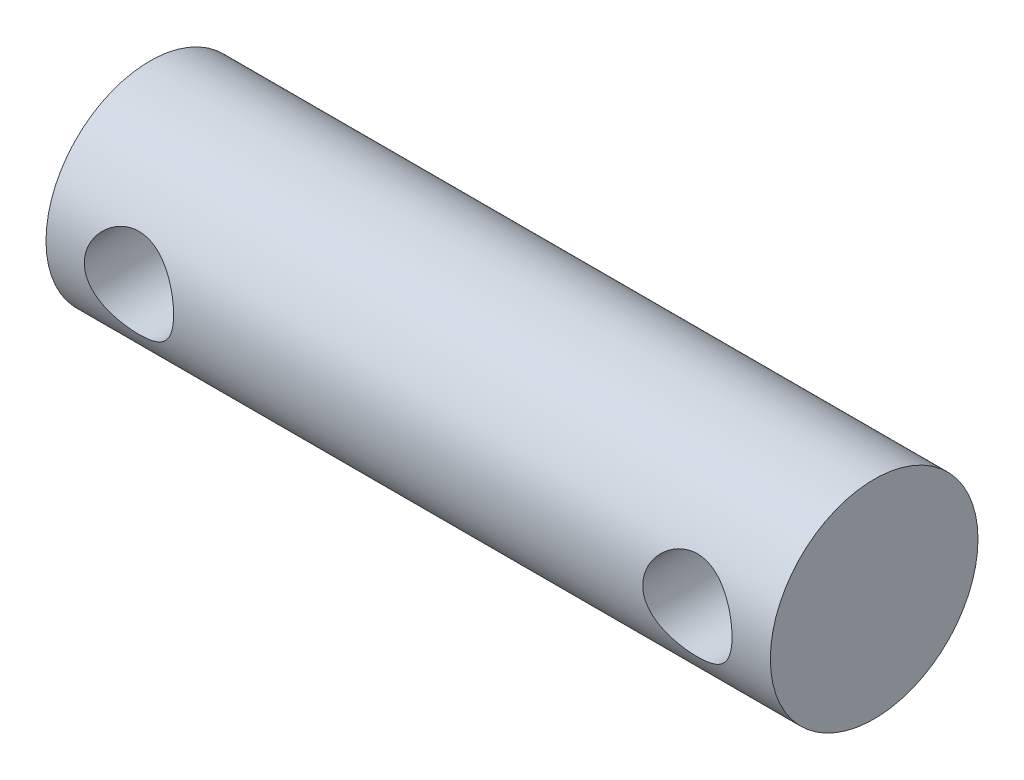
ISO-10303-21;
HEADER;
FILE_DESCRIPTION(('STEP AP214'),'2;1');
FILE_NAME('part.step','',(''),(''),'','','');
FILE_SCHEMA(('AUTOMOTIVE_DESIGN { 1 0 10303 214 1 1 1 1 }'));
ENDSEC;
DATA;
#1=APPLICATION_CONTEXT('core data for automotive mechanical design processes');
#2=APPLICATION_PROTOCOL_DEFINITION('international standard','automotive_design',2000,#1);
#3=PRODUCT_CONTEXT('',#1,'mechanical');
#4=PRODUCT('Part','Part','',(#3));
#5=PRODUCT_RELATED_PRODUCT_CATEGORY('part','',(#4));
#6=PRODUCT_DEFINITION_FORMATION('','',#4);
#7=PRODUCT_DEFINITION_CONTEXT('part definition',#1,'design');
#8=PRODUCT_DEFINITION('design','',#6,#7);
#9=PRODUCT_DEFINITION_SHAPE('','',#8);
#10=(LENGTH_UNIT() NAMED_UNIT(*) SI_UNIT(.MILLI.,.METRE.));
#11=(NAMED_UNIT(*) PLANE_ANGLE_UNIT() SI_UNIT($,.RADIAN.));
#12=(NAMED_UNIT(*) SI_UNIT($,.STERADIAN.) SOLID_ANGLE_UNIT());
#13=UNCERTAINTY_MEASURE_WITH_UNIT(LENGTH_MEASURE(1.E-05),#10,'distance_accuracy_value','');
#14=(GEOMETRIC_REPRESENTATION_CONTEXT(3) GLOBAL_UNCERTAINTY_ASSIGNED_CONTEXT((#13)) GLOBAL_UNIT_ASSIGNED_CONTEXT((#10,
#11,#12)) REPRESENTATION_CONTEXT('',''));
#15=CARTESIAN_POINT('',(0.,0.,0.));
#16=DIRECTION('',(0.,0.,1.));
#17=DIRECTION('',(1.,0.,0.));
#18=AXIS2_PLACEMENT_3D('',#15,#16,#17);
#19=CARTESIAN_POINT('',(20.8457458767143,49.8361725350088,-136.328078847471));
#20=DIRECTION('',(1.,0.,0.));
#21=DIRECTION('',(0.,0.,-1.));
#22=AXIS2_PLACEMENT_3D('',#19,#20,#21);
#23=CYLINDRICAL_SURFACE('',#22,4.99999999999999);
#24=CARTESIAN_POINT('',(53.8807458847143,49.8361725350088,-141.328078847471));
#25=CARTESIAN_POINT('',(53.8807411802356,49.7213369896127,-141.328075067452));
#26=CARTESIAN_POINT('',(53.8714914076802,49.6063117996981,-141.324078109135));
#27=CARTESIAN_POINT('',(53.8348490346011,49.3795494889542,-141.308488774647));
#28=CARTESIAN_POINT('',(53.8074108191502,49.2678213746283,-141.296877302769));
#29=CARTESIAN_POINT('',(53.7355962268532,49.0512930292338,-141.267295678108));
#30=CARTESIAN_POINT('',(53.691278719821,48.9464701885056,-141.249347641043));
#31=CARTESIAN_POINT('',(53.5872173106792,48.7458550672259,-141.208826250953));
#32=CARTESIAN_POINT('',(53.5274775283895,48.6500603842579,-141.186254133511));
#33=CARTESIAN_POINT('',(53.3909438294606,48.4650074029306,-141.137393073467));
#34=CARTESIAN_POINT('',(53.3134662866216,48.3762872805437,-141.110977364866));
#35=CARTESIAN_POINT('',(53.1451045551984,48.2126316034261,-141.057934030835));
#36=CARTESIAN_POINT('',(53.0542129263495,48.13770375089,-141.031306295606));
#37=CARTESIAN_POINT('',(52.8557515060694,47.9998117612172,-140.979261881125));
#38=CARTESIAN_POINT('',(52.7475517668871,47.9376959146999,-140.95398494367));
#39=CARTESIAN_POINT('',(52.5209996221841,47.8327860678183,-140.909532004697));
#40=CARTESIAN_POINT('',(52.4026528223709,47.7899814798279,-140.890352661809));
#41=CARTESIAN_POINT('',(52.1653608016077,47.7271680330151,-140.861647577703));
#42=CARTESIAN_POINT('',(52.046745718155,47.706119948683,-140.851684409893));
#43=CARTESIAN_POINT('',(51.807281353157,47.6841793415416,-140.841291526017));
#44=CARTESIAN_POINT('',(51.686433466394,47.6832746350607,-140.840856047155));
#45=CARTESIAN_POINT('',(51.4566077729839,47.7008674530557,-140.849200025902));
#46=CARTESIAN_POINT('',(51.3474744484552,47.7177674928992,-140.857220810386));
#47=CARTESIAN_POINT('',(51.1337769439751,47.7677973338567,-140.880284318974));
#48=CARTESIAN_POINT('',(51.0292137128958,47.8009304881213,-140.895328493815));
#49=CARTESIAN_POINT('',(50.8248988952264,47.8831394881385,-140.931088855414));
#50=CARTESIAN_POINT('',(50.7253027276143,47.9325484248617,-140.951921987515));
#51=CARTESIAN_POINT('',(50.5354113274809,48.0456692162852,-140.99688993182));
#52=CARTESIAN_POINT('',(50.4451199115105,48.1093869062414,-141.021026089459));
#53=CARTESIAN_POINT('',(50.2677937446391,48.2560839552132,-141.072537302096));
#54=CARTESIAN_POINT('',(50.1817944834399,48.3402851248689,-141.100007723881));
#55=CARTESIAN_POINT('',(50.024776774551,48.5221680494348,-141.153259303188));
#56=CARTESIAN_POINT('',(49.9537623024733,48.6198533704806,-141.179040011164));
#57=CARTESIAN_POINT('',(49.8270746565194,48.8292531847971,-141.226846767644));
#58=CARTESIAN_POINT('',(49.7718489694413,48.941266686661,-141.248757604676));
#59=CARTESIAN_POINT('',(49.6813936690745,49.1741779591023,-141.285459672719));
#60=CARTESIAN_POINT('',(49.6461522678741,49.2950704446931,-141.300255100035));
#61=CARTESIAN_POINT('',(49.598893970074,49.5336772935446,-141.320259588004));
#62=CARTESIAN_POINT('',(49.5854890533469,49.6510687769145,-141.326040481519));
#63=CARTESIAN_POINT('',(49.5781135891824,49.8865578475027,-141.329209719753));
#64=CARTESIAN_POINT('',(49.5841369915106,50.00465520347,-141.326600677208));
#65=CARTESIAN_POINT('',(49.6144774032279,50.2315292037977,-141.313650457344));
#66=CARTESIAN_POINT('',(49.6377967120125,50.3404661743029,-141.303731158168));
#67=CARTESIAN_POINT('',(49.7006526219519,50.552747879974,-141.277620687335));
#68=CARTESIAN_POINT('',(49.7401912371047,50.6560919188449,-141.261428736797));
#69=CARTESIAN_POINT('',(49.8356450316057,50.8579082201138,-141.223681958431));
#70=CARTESIAN_POINT('',(49.892033179043,50.9561274704354,-141.201975411841));
#71=CARTESIAN_POINT('',(50.0190684371405,51.1420637961909,-141.155484785512));
#72=CARTESIAN_POINT('',(50.0897216483134,51.2297763527376,-141.130699390841));
#73=CARTESIAN_POINT('',(50.249538736721,51.3992126278181,-141.07837927341));
#74=CARTESIAN_POINT('',(50.339700161327,51.4799774705762,-141.050778609613));
#75=CARTESIAN_POINT('',(50.5326921631512,51.6255241740811,-140.997579889869));
#76=CARTESIAN_POINT('',(50.6355263329052,51.6903014869005,-140.971982405171));
#77=CARTESIAN_POINT('',(50.8535852186567,51.8030016947206,-140.925402531285));
#78=CARTESIAN_POINT('',(50.9690032476606,51.8505922188222,-140.904513818171));
#79=CARTESIAN_POINT('',(51.2074016875701,51.9252333108666,-140.870933764693));
#80=CARTESIAN_POINT('',(51.3303752053673,51.9523023090478,-140.858235070464));
#81=CARTESIAN_POINT('',(51.5696865736272,51.9832456094708,-140.843645592454));
#82=CARTESIAN_POINT('',(51.6857573928043,51.9888178074857,-140.840964207638));
#83=CARTESIAN_POINT('',(51.9171262787046,51.9812020213465,-140.844589461941));
#84=CARTESIAN_POINT('',(52.0324244803064,51.9680174021423,-140.850894488908));
#85=CARTESIAN_POINT('',(52.2526801151096,51.9247183126663,-140.871039887736));
#86=CARTESIAN_POINT('',(52.3578621557099,51.8955340173604,-140.884465029838));
#87=CARTESIAN_POINT('',(52.5618442720251,51.822006970618,-140.916985989167));
#88=CARTESIAN_POINT('',(52.6606425210889,51.7776599031602,-140.936083420785));
#89=CARTESIAN_POINT('',(52.8557679014342,51.671900332346,-140.979267334837));
#90=CARTESIAN_POINT('',(52.9515594848078,51.6095982359687,-141.003590182213));
#91=CARTESIAN_POINT('',(53.1318582364724,51.4708994582845,-141.053870384485));
#92=CARTESIAN_POINT('',(53.2163610755024,51.3944973962034,-141.079828360873));
#93=CARTESIAN_POINT('',(53.3786223322724,51.2225566990761,-141.132936176252));
#94=CARTESIAN_POINT('',(53.4553073133174,51.125978489302,-141.160016245078));
#95=CARTESIAN_POINT('',(53.591465044063,50.9203428016935,-141.210267086977));
#96=CARTESIAN_POINT('',(53.6509299899203,50.8112796970469,-141.233436085639));
#97=CARTESIAN_POINT('',(53.7497896395524,50.5851555298285,-141.272976217368));
#98=CARTESIAN_POINT('',(53.7894593946621,50.4682312655781,-141.289439891174));
#99=CARTESIAN_POINT('',(53.8481834507368,50.2286930464141,-141.314091221618));
#100=CARTESIAN_POINT('',(53.8673015341711,50.1060979337551,-141.322304478337));
#101=CARTESIAN_POINT('',(53.8774059326409,49.9584610253603,-141.326643793397));
#102=CARTESIAN_POINT('',(53.8786573438208,49.9340255241093,-141.32718109063));
#103=CARTESIAN_POINT('',(53.8803278240239,49.8851203993388,-141.327899021725));
#104=CARTESIAN_POINT('',(53.8807468875168,49.8606507755937,-141.328079653217));
#105=CARTESIAN_POINT('',(53.8807458847143,49.8361725350088,-141.328078847471));
#106=B_SPLINE_CURVE_WITH_KNOTS('',3,(#24,#25,#26,#27,#28,#29,#30,#31,#32,#33,#34,#35,#36,#37,
#38,#39,#40,#41,#42,#43,#44,#45,#46,#47,#48,#49,#50,#51,#52,#53,#54,#55,#56,#57,#58,#59,#60,#61,
#62,#63,#64,#65,#66,#67,#68,#69,#70,#71,#72,#73,#74,#75,#76,#77,#78,#79,#80,#81,#82,#83,#84,#85,
#86,#87,#88,#89,#90,#91,#92,#93,#94,#95,#96,#97,#98,#99,#100,#101,#102,#103,#104,#105),
.UNSPECIFIED.,.T.,.F.,(4,2,2,2,2,2,2,2,2,2,2,2,2,2,2,2,2,2,2,2,2,2,2,2,2,2,2,2,2,2,2,2,2,2,2,2,
2,2,2,2,4),(0.,0.344405597006513,0.689678215710455,1.03375749548488,1.37774495479788,
1.73832500006838,2.09910580181024,2.47907574725535,2.85883711575798,3.2194780043205,
3.579900754214,3.91053324750238,4.24123406583687,4.57917351290038,4.91725102620772,
5.28594614852576,5.65473896663791,6.03313216257345,6.41130192707087,6.76433488987351,
7.11725792417767,7.45126692486653,7.78531741297641,8.1298024719689,8.4744351646423,
8.84520811413964,9.21608641511609,9.59379501860373,9.97116400148108,10.3180317835198,
10.6648373457531,10.9933406179796,11.3219374752747,11.6709643688181,12.0201247331079,
12.397098263593,12.774242366029,13.1459890606213,13.5165786721775,13.5899913687512,
13.6634045530858),.UNSPECIFIED.);
#107=CARTESIAN_POINT('',(53.8807458847143,49.8361725350088,-141.328078847471));
#108=VERTEX_POINT('',#107);
#109=EDGE_CURVE('E10',#108,#108,#106,.T.);
#110=ORIENTED_EDGE('',*,*,#109,.F.);
#111=EDGE_LOOP('',(#110));
#112=FACE_BOUND('',#111,.T.);
#113=CARTESIAN_POINT('',(53.8807458847143,49.8361725350088,-131.328078847471));
#114=CARTESIAN_POINT('',(53.8807411802356,49.9510080804048,-131.32808262749));
#115=CARTESIAN_POINT('',(53.8714914076802,50.0660332703194,-131.332079585807));
#116=CARTESIAN_POINT('',(53.8348490346011,50.2927955810633,-131.347668920295));
#117=CARTESIAN_POINT('',(53.8074108191503,50.4045236953892,-131.359280392173));
#118=CARTESIAN_POINT('',(53.7355962268533,50.6210520407837,-131.388862016835));
#119=CARTESIAN_POINT('',(53.691278719821,50.7258748815119,-131.4068100539));
#120=CARTESIAN_POINT('',(53.5872173106792,50.9264900027917,-131.447331443989));
#121=CARTESIAN_POINT('',(53.5274775283895,51.0222846857596,-131.469903561432));
#122=CARTESIAN_POINT('',(53.3909438294606,51.2073376670869,-131.518764621476));
#123=CARTESIAN_POINT('',(53.3134662866216,51.2960577894738,-131.545180330076));
#124=CARTESIAN_POINT('',(53.1451045551984,51.4597134665914,-131.598223664108));
#125=CARTESIAN_POINT('',(53.0542129263496,51.5346413191275,-131.624851399336));
#126=CARTESIAN_POINT('',(52.8557515060694,51.6725333088004,-131.676895813818));
#127=CARTESIAN_POINT('',(52.7475517668871,51.7346491553176,-131.702172751273));
#128=CARTESIAN_POINT('',(52.5209996221841,51.8395590021992,-131.746625690245));
#129=CARTESIAN_POINT('',(52.4026528223709,51.8823635901896,-131.765805033133));
#130=CARTESIAN_POINT('',(52.1653608016078,51.9451770370024,-131.794510117239));
#131=CARTESIAN_POINT('',(52.0467457181551,51.9662251213346,-131.804473285049));
#132=CARTESIAN_POINT('',(51.807281353157,51.9881657284759,-131.814866168925));
#133=CARTESIAN_POINT('',(51.686433466394,51.9890704349569,-131.815301647788));
#134=CARTESIAN_POINT('',(51.456607772984,51.9714776169619,-131.806957669041));
#135=CARTESIAN_POINT('',(51.3474744484552,51.9545775771183,-131.798936884557));
#136=CARTESIAN_POINT('',(51.1337769439752,51.9045477361609,-131.775873375969));
#137=CARTESIAN_POINT('',(51.0292137128958,51.8714145818962,-131.760829201127));
#138=CARTESIAN_POINT('',(50.8248988952264,51.789205581879,-131.725068839528));
#139=CARTESIAN_POINT('',(50.7253027276143,51.7397966451559,-131.704235707427));
#140=CARTESIAN_POINT('',(50.5354113274809,51.6266758537323,-131.659267763122));
#141=CARTESIAN_POINT('',(50.4451199115105,51.5629581637761,-131.635131605484));
#142=CARTESIAN_POINT('',(50.2677937446391,51.4162611148043,-131.583620392847));
#143=CARTESIAN_POINT('',(50.1817944834399,51.3320599451486,-131.556149971061));
#144=CARTESIAN_POINT('',(50.024776774551,51.1501770205827,-131.502898391754));
#145=CARTESIAN_POINT('',(49.9537623024733,51.052491699537,-131.477117683778));
#146=CARTESIAN_POINT('',(49.8270746565194,50.8430918852205,-131.429310927299));
#147=CARTESIAN_POINT('',(49.7718489694413,50.7310783833565,-131.407400090266));
#148=CARTESIAN_POINT('',(49.6813936690745,50.4981671109153,-131.370698022223));
#149=CARTESIAN_POINT('',(49.6461522678741,50.3772746253244,-131.355902594908));
#150=CARTESIAN_POINT('',(49.598893970074,50.1386677764729,-131.335898106939));
#151=CARTESIAN_POINT('',(49.5854890533469,50.0212762931031,-131.330117213423));
#152=CARTESIAN_POINT('',(49.5781135891825,49.7857872225149,-131.326947975189));
#153=CARTESIAN_POINT('',(49.5841369915106,49.6676898665475,-131.329557017734));
#154=CARTESIAN_POINT('',(49.6144774032279,49.4408158662198,-131.342507237599));
#155=CARTESIAN_POINT('',(49.6377967120125,49.3318788957146,-131.352426536774));
#156=CARTESIAN_POINT('',(49.7006526219519,49.1195971900435,-131.378537007608));
#157=CARTESIAN_POINT('',(49.7401912371047,49.0162531511726,-131.394728958145));
#158=CARTESIAN_POINT('',(49.8356450316057,48.8144368499038,-131.432475736512));
#159=CARTESIAN_POINT('',(49.892033179043,48.7162175995822,-131.454182283102));
#160=CARTESIAN_POINT('',(50.0190684371404,48.5302812738267,-131.500672909431));
#161=CARTESIAN_POINT('',(50.0897216483134,48.44256871728,-131.525458304101));
#162=CARTESIAN_POINT('',(50.249538736721,48.2731324421995,-131.577778421533));
#163=CARTESIAN_POINT('',(50.3397001613269,48.1923675994414,-131.605379085329));
#164=CARTESIAN_POINT('',(50.5326921631512,48.0468208959365,-131.658577805073));
#165=CARTESIAN_POINT('',(50.6355263329051,47.9820435831171,-131.684175289771));
#166=CARTESIAN_POINT('',(50.8535852186567,47.8693433752969,-131.730755163657));
#167=CARTESIAN_POINT('',(50.9690032476606,47.8217528511953,-131.751643876771));
#168=CARTESIAN_POINT('',(51.2074016875701,47.7471117591509,-131.785223930249));
#169=CARTESIAN_POINT('',(51.3303752053672,47.7200427609698,-131.797922624478));
#170=CARTESIAN_POINT('',(51.5696865736272,47.6890994605467,-131.812512102489));
#171=CARTESIAN_POINT('',(51.6857573928043,47.6835272625319,-131.815193487304));
#172=CARTESIAN_POINT('',(51.9171262787046,47.691143048671,-131.811568233002));
#173=CARTESIAN_POINT('',(52.0324244803064,47.7043276678752,-131.805263206034));
#174=CARTESIAN_POINT('',(52.2526801151096,47.7476267573512,-131.785117807206));
#175=CARTESIAN_POINT('',(52.3578621557099,47.7768110526571,-131.771692665105));
#176=CARTESIAN_POINT('',(52.5618442720251,47.8503380993996,-131.739171705775));
#177=CARTESIAN_POINT('',(52.6606425210889,47.8946851668573,-131.720074274157));
#178=CARTESIAN_POINT('',(52.8557679014342,48.0004447376715,-131.676890360105));
#179=CARTESIAN_POINT('',(52.9515594848077,48.0627468340488,-131.652567512729));
#180=CARTESIAN_POINT('',(53.1318582364723,48.201445611733,-131.602287310457));
#181=CARTESIAN_POINT('',(53.2163610755024,48.2778476738141,-131.576329334069));
#182=CARTESIAN_POINT('',(53.3786223322724,48.4497883709415,-131.523221518691));
#183=CARTESIAN_POINT('',(53.4553073133174,48.5463665807155,-131.496141449865));
#184=CARTESIAN_POINT('',(53.591465044063,48.752002268324,-131.445890607965));
#185=CARTESIAN_POINT('',(53.6509299899202,48.8610653729706,-131.422721609303));
#186=CARTESIAN_POINT('',(53.7497896395524,49.087189540189,-131.383181477574));
#187=CARTESIAN_POINT('',(53.7894593946621,49.2041138044394,-131.366717803769));
#188=CARTESIAN_POINT('',(53.8481834507368,49.4436520236034,-131.342066473325));
#189=CARTESIAN_POINT('',(53.8673015341711,49.5662471362624,-131.333853216606));
#190=CARTESIAN_POINT('',(53.8774059326409,49.7138840446572,-131.329513901545));
#191=CARTESIAN_POINT('',(53.8786573438208,49.7383195459082,-131.328976604312));
#192=CARTESIAN_POINT('',(53.8803278240239,49.7872246706787,-131.328258673218));
#193=CARTESIAN_POINT('',(53.8807468875168,49.8116942944238,-131.328078041726));
#194=CARTESIAN_POINT('',(53.8807458847143,49.8361725350088,-131.328078847471));
#195=B_SPLINE_CURVE_WITH_KNOTS('',3,(#113,#114,#115,#116,#117,#118,#119,#120,#121,#122,#123,
#124,#125,#126,#127,#128,#129,#130,#131,#132,#133,#134,#135,#136,#137,#138,#139,#140,#141,#142,
#143,#144,#145,#146,#147,#148,#149,#150,#151,#152,#153,#154,#155,#156,#157,#158,#159,#160,#161,
#162,#163,#164,#165,#166,#167,#168,#169,#170,#171,#172,#173,#174,#175,#176,#177,#178,#179,#180,
#181,#182,#183,#184,#185,#186,#187,#188,#189,#190,#191,#192,#193,#194),.UNSPECIFIED.,.T.,.F.,(4,
2,2,2,2,2,2,2,2,2,2,2,2,2,2,2,2,2,2,2,2,2,2,2,2,2,2,2,2,2,2,2,2,2,2,2,2,2,2,2,4),(0.,
0.344405597006499,0.689678215710455,1.03375749548489,1.37774495479789,1.73832500006837,
2.09910580181024,2.47907574725534,2.85883711575796,3.21947800432048,3.579900754214,
3.91053324750237,4.24123406583686,4.57917351290038,4.91725102620771,5.28594614852574,
5.65473896663791,6.03313216257345,6.41130192707086,6.7643348898735,7.11725792417767,
7.45126692486653,7.78531741297641,8.12980247196888,8.47443516464229,8.84520811413963,
9.21608641511608,9.59379501860372,9.97116400148107,10.3180317835198,10.6648373457531,
10.9933406179797,11.3219374752747,11.6709643688181,12.0201247331079,12.397098263593,
12.774242366029,13.1459890606213,13.5165786721774,13.5899913687512,13.6634045530858),.UNSPECIFIED.);
#196=CARTESIAN_POINT('',(53.8807458847143,49.8361725350088,-131.328078847471));
#197=VERTEX_POINT('',#196);
#198=EDGE_CURVE('E43',#197,#197,#195,.T.);
#199=ORIENTED_EDGE('',*,*,#198,.F.);
#200=EDGE_LOOP('',(#199));
#201=FACE_BOUND('',#200,.T.);
#202=CARTESIAN_POINT('',(26.9907538847143,49.8361725350088,-141.328078847471));
#203=CARTESIAN_POINT('',(26.9907491802355,49.7213369896127,-141.328075067452));
#204=CARTESIAN_POINT('',(26.9814994076802,49.6063117996981,-141.324078109135));
#205=CARTESIAN_POINT('',(26.9448570346011,49.3795494889542,-141.308488774647));
#206=CARTESIAN_POINT('',(26.9174188191502,49.2678213746283,-141.296877302769));
#207=CARTESIAN_POINT('',(26.8456042268532,49.0512930292338,-141.267295678108));
#208=CARTESIAN_POINT('',(26.8012867198209,48.9464701885056,-141.249347641043));
#209=CARTESIAN_POINT('',(26.6972253106792,48.7458550672258,-141.208826250953));
#210=CARTESIAN_POINT('',(26.6374855283895,48.6500603842579,-141.186254133511));
#211=CARTESIAN_POINT('',(26.5009518294606,48.4650074029306,-141.137393073467));
#212=CARTESIAN_POINT('',(26.4234742866216,48.3762872805437,-141.110977364866));
#213=CARTESIAN_POINT('',(26.2551125551984,48.2126316034261,-141.057934030835));
#214=CARTESIAN_POINT('',(26.1642209263495,48.13770375089,-141.031306295606));
#215=CARTESIAN_POINT('',(25.9657595060693,47.9998117612172,-140.979261881125));
#216=CARTESIAN_POINT('',(25.857559766887,47.9376959146999,-140.95398494367));
#217=CARTESIAN_POINT('',(25.6310076221841,47.8327860678183,-140.909532004697));
#218=CARTESIAN_POINT('',(25.5126608223708,47.7899814798279,-140.890352661809));
#219=CARTESIAN_POINT('',(25.2753688016077,47.7271680330151,-140.861647577703));
#220=CARTESIAN_POINT('',(25.156753718155,47.706119948683,-140.851684409893));
#221=CARTESIAN_POINT('',(24.9172893531569,47.6841793415416,-140.841291526017));
#222=CARTESIAN_POINT('',(24.796441466394,47.6832746350607,-140.840856047155));
#223=CARTESIAN_POINT('',(24.5666157729839,47.7008674530557,-140.849200025902));
#224=CARTESIAN_POINT('',(24.4574824484551,47.7177674928992,-140.857220810386));
#225=CARTESIAN_POINT('',(24.2437849439751,47.7677973338567,-140.880284318973));
#226=CARTESIAN_POINT('',(24.1392217128958,47.8009304881213,-140.895328493815));
#227=CARTESIAN_POINT('',(23.9349068952263,47.8831394881385,-140.931088855414));
#228=CARTESIAN_POINT('',(23.8353107276143,47.9325484248617,-140.951921987515));
#229=CARTESIAN_POINT('',(23.6454193274809,48.0456692162852,-140.99688993182));
#230=CARTESIAN_POINT('',(23.5551279115105,48.1093869062414,-141.021026089458));
#231=CARTESIAN_POINT('',(23.3778017446391,48.2560839552132,-141.072537302095));
#232=CARTESIAN_POINT('',(23.2918024834399,48.3402851248689,-141.100007723881));
#233=CARTESIAN_POINT('',(23.1347847745509,48.5221680494348,-141.153259303188));
#234=CARTESIAN_POINT('',(23.0637703024732,48.6198533704806,-141.179040011164));
#235=CARTESIAN_POINT('',(22.9370826565194,48.8292531847971,-141.226846767644));
#236=CARTESIAN_POINT('',(22.8818569694413,48.941266686661,-141.248757604676));
#237=CARTESIAN_POINT('',(22.7914016690744,49.1741779591023,-141.285459672719));
#238=CARTESIAN_POINT('',(22.7561602678741,49.2950704446931,-141.300255100035));
#239=CARTESIAN_POINT('',(22.708901970074,49.5336772935446,-141.320259588004));
#240=CARTESIAN_POINT('',(22.6954970533469,49.6510687769145,-141.326040481519));
#241=CARTESIAN_POINT('',(22.6881215891824,49.8865578475027,-141.329209719753));
#242=CARTESIAN_POINT('',(22.6941449915106,50.00465520347,-141.326600677208));
#243=CARTESIAN_POINT('',(22.7244854032278,50.2315292037977,-141.313650457344));
#244=CARTESIAN_POINT('',(22.7478047120125,50.340466174303,-141.303731158168));
#245=CARTESIAN_POINT('',(22.8106606219519,50.5527478799741,-141.277620687335));
#246=CARTESIAN_POINT('',(22.8501992371047,50.6560919188449,-141.261428736797));
#247=CARTESIAN_POINT('',(22.9456530316057,50.8579082201138,-141.22368195843));
#248=CARTESIAN_POINT('',(23.002041179043,50.9561274704354,-141.201975411841));
#249=CARTESIAN_POINT('',(23.1290764371404,51.1420637961909,-141.155484785512));
#250=CARTESIAN_POINT('',(23.1997296483134,51.2297763527376,-141.130699390841));
#251=CARTESIAN_POINT('',(23.359546736721,51.3992126278181,-141.07837927341));
#252=CARTESIAN_POINT('',(23.4497081613269,51.4799774705762,-141.050778609613));
#253=CARTESIAN_POINT('',(23.6427001631512,51.6255241740811,-140.997579889869));
#254=CARTESIAN_POINT('',(23.7455343329051,51.6903014869005,-140.971982405171));
#255=CARTESIAN_POINT('',(23.9635932186567,51.8030016947206,-140.925402531285));
#256=CARTESIAN_POINT('',(24.0790112476606,51.8505922188222,-140.904513818171));
#257=CARTESIAN_POINT('',(24.3174096875701,51.9252333108666,-140.870933764693));
#258=CARTESIAN_POINT('',(24.4403832053672,51.9523023090477,-140.858235070464));
#259=CARTESIAN_POINT('',(24.6796945736272,51.9832456094708,-140.843645592454));
#260=CARTESIAN_POINT('',(24.7957653928043,51.9888178074856,-140.840964207638));
#261=CARTESIAN_POINT('',(25.0271342787046,51.9812020213465,-140.844589461941));
#262=CARTESIAN_POINT('',(25.1424324803064,51.9680174021423,-140.850894488908));
#263=CARTESIAN_POINT('',(25.3626881151096,51.9247183126663,-140.871039887736));
#264=CARTESIAN_POINT('',(25.4678701557099,51.8955340173604,-140.884465029838));
#265=CARTESIAN_POINT('',(25.671852272025,51.822006970618,-140.916985989167));
#266=CARTESIAN_POINT('',(25.7706505210889,51.7776599031602,-140.936083420785));
#267=CARTESIAN_POINT('',(25.9657759014342,51.671900332346,-140.979267334837));
#268=CARTESIAN_POINT('',(26.0615674848077,51.6095982359687,-141.003590182213));
#269=CARTESIAN_POINT('',(26.2418662364723,51.4708994582845,-141.053870384485));
#270=CARTESIAN_POINT('',(26.3263690755023,51.3944973962034,-141.079828360873));
#271=CARTESIAN_POINT('',(26.4886303322724,51.2225566990761,-141.132936176252));
#272=CARTESIAN_POINT('',(26.5653153133174,51.125978489302,-141.160016245078));
#273=CARTESIAN_POINT('',(26.701473044063,50.9203428016935,-141.210267086977));
#274=CARTESIAN_POINT('',(26.7609379899202,50.8112796970469,-141.233436085639));
#275=CARTESIAN_POINT('',(26.8597976395524,50.5851555298285,-141.272976217368));
#276=CARTESIAN_POINT('',(26.8994673946621,50.4682312655781,-141.289439891174));
#277=CARTESIAN_POINT('',(26.9581914507367,50.2286930464141,-141.314091221617));
#278=CARTESIAN_POINT('',(26.9773095341711,50.1060979337551,-141.322304478337));
#279=CARTESIAN_POINT('',(26.9874139326408,49.9584610253603,-141.326643793397));
#280=CARTESIAN_POINT('',(26.9886653438208,49.9340255241093,-141.32718109063));
#281=CARTESIAN_POINT('',(26.9903358240238,49.8851203993388,-141.327899021725));
#282=CARTESIAN_POINT('',(26.9907548875167,49.8606507755937,-141.328079653217));
#283=CARTESIAN_POINT('',(26.9907538847143,49.8361725350088,-141.328078847471));
#284=B_SPLINE_CURVE_WITH_KNOTS('',3,(#202,#203,#204,#205,#206,#207,#208,#209,#210,#211,#212,
#213,#214,#215,#216,#217,#218,#219,#220,#221,#222,#223,#224,#225,#226,#227,#228,#229,#230,#231,
#232,#233,#234,#235,#236,#237,#238,#239,#240,#241,#242,#243,#244,#245,#246,#247,#248,#249,#250,
#251,#252,#253,#254,#255,#256,#257,#258,#259,#260,#261,#262,#263,#264,#265,#266,#267,#268,#269,
#270,#271,#272,#273,#274,#275,#276,#277,#278,#279,#280,#281,#282,#283),.UNSPECIFIED.,.T.,.F.,(4,
2,2,2,2,2,2,2,2,2,2,2,2,2,2,2,2,2,2,2,2,2,2,2,2,2,2,2,2,2,2,2,2,2,2,2,2,2,2,2,4),(0.,
0.344405597006506,0.689678215710458,1.0337574954849,1.3777449547979,1.73832500006839,
2.09910580181025,2.47907574725537,2.85883711575797,3.21947800432049,3.57990075421401,
3.91053324750238,4.24123406583687,4.57917351290039,4.91725102620772,5.28594614852577,
5.6547389666379,6.03313216257345,6.41130192707087,6.76433488987351,7.11725792417768,
7.45126692486654,7.78531741297642,8.12980247196889,8.4744351646423,8.84520811413963,
9.21608641511609,9.59379501860373,9.97116400148107,10.3180317835198,10.6648373457531,
10.9933406179796,11.3219374752747,11.6709643688181,12.0201247331079,12.397098263593,
12.774242366029,13.1459890606213,13.5165786721774,13.5899913687512,13.6634045530857),.UNSPECIFIED.);
#285=CARTESIAN_POINT('',(26.9907538847143,49.8361725350088,-141.328078847471));
#286=VERTEX_POINT('',#285);
#287=EDGE_CURVE('E47',#286,#286,#284,.T.);
#288=ORIENTED_EDGE('',*,*,#287,.F.);
#289=EDGE_LOOP('',(#288));
#290=FACE_BOUND('',#289,.T.);
#291=CARTESIAN_POINT('',(26.9907538847143,49.8361725350088,-131.328078847471));
#292=CARTESIAN_POINT('',(26.9907491802355,49.9510080804048,-131.32808262749));
#293=CARTESIAN_POINT('',(26.9814994076802,50.0660332703194,-131.332079585807));
#294=CARTESIAN_POINT('',(26.9448570346011,50.2927955810633,-131.347668920295));
#295=CARTESIAN_POINT('',(26.9174188191502,50.4045236953892,-131.359280392173));
#296=CARTESIAN_POINT('',(26.8456042268532,50.6210520407837,-131.388862016835));
#297=CARTESIAN_POINT('',(26.8012867198209,50.7258748815119,-131.406810053899));
#298=CARTESIAN_POINT('',(26.6972253106792,50.9264900027917,-131.447331443989));
#299=CARTESIAN_POINT('',(26.6374855283895,51.0222846857596,-131.469903561432));
#300=CARTESIAN_POINT('',(26.5009518294606,51.2073376670869,-131.518764621475));
#301=CARTESIAN_POINT('',(26.4234742866216,51.2960577894738,-131.545180330076));
#302=CARTESIAN_POINT('',(26.2551125551984,51.4597134665914,-131.598223664108));
#303=CARTESIAN_POINT('',(26.1642209263495,51.5346413191275,-131.624851399336));
#304=CARTESIAN_POINT('',(25.9657595060694,51.6725333088003,-131.676895813818));
#305=CARTESIAN_POINT('',(25.8575597668871,51.7346491553176,-131.702172751273));
#306=CARTESIAN_POINT('',(25.6310076221841,51.8395590021992,-131.746625690245));
#307=CARTESIAN_POINT('',(25.5126608223708,51.8823635901896,-131.765805033133));
#308=CARTESIAN_POINT('',(25.2753688016077,51.9451770370024,-131.794510117239));
#309=CARTESIAN_POINT('',(25.156753718155,51.9662251213345,-131.804473285049));
#310=CARTESIAN_POINT('',(24.917289353157,51.9881657284759,-131.814866168925));
#311=CARTESIAN_POINT('',(24.796441466394,51.9890704349568,-131.815301647788));
#312=CARTESIAN_POINT('',(24.5666157729839,51.9714776169619,-131.806957669041));
#313=CARTESIAN_POINT('',(24.4574824484552,51.9545775771183,-131.798936884557));
#314=CARTESIAN_POINT('',(24.2437849439751,51.9045477361608,-131.775873375969));
#315=CARTESIAN_POINT('',(24.1392217128958,51.8714145818962,-131.760829201127));
#316=CARTESIAN_POINT('',(23.9349068952263,51.789205581879,-131.725068839528));
#317=CARTESIAN_POINT('',(23.8353107276143,51.7397966451558,-131.704235707427));
#318=CARTESIAN_POINT('',(23.6454193274809,51.6266758537323,-131.659267763122));
#319=CARTESIAN_POINT('',(23.5551279115105,51.5629581637761,-131.635131605484));
#320=CARTESIAN_POINT('',(23.3778017446391,51.4162611148043,-131.583620392847));
#321=CARTESIAN_POINT('',(23.2918024834399,51.3320599451486,-131.556149971061));
#322=CARTESIAN_POINT('',(23.134784774551,51.1501770205827,-131.502898391754));
#323=CARTESIAN_POINT('',(23.0637703024732,51.052491699537,-131.477117683778));
#324=CARTESIAN_POINT('',(22.9370826565194,50.8430918852204,-131.429310927299));
#325=CARTESIAN_POINT('',(22.8818569694413,50.7310783833565,-131.407400090266));
#326=CARTESIAN_POINT('',(22.7914016690744,50.4981671109152,-131.370698022223));
#327=CARTESIAN_POINT('',(22.7561602678741,50.3772746253244,-131.355902594908));
#328=CARTESIAN_POINT('',(22.708901970074,50.1386677764729,-131.335898106939));
#329=CARTESIAN_POINT('',(22.6954970533469,50.021276293103,-131.330117213423));
#330=CARTESIAN_POINT('',(22.6881215891824,49.7857872225148,-131.326947975189));
#331=CARTESIAN_POINT('',(22.6941449915106,49.6676898665475,-131.329557017734));
#332=CARTESIAN_POINT('',(22.7244854032278,49.4408158662198,-131.342507237599));
#333=CARTESIAN_POINT('',(22.7478047120125,49.3318788957146,-131.352426536774));
#334=CARTESIAN_POINT('',(22.8106606219519,49.1195971900435,-131.378537007607));
#335=CARTESIAN_POINT('',(22.8501992371047,49.0162531511726,-131.394728958145));
#336=CARTESIAN_POINT('',(22.9456530316057,48.8144368499037,-131.432475736512));
#337=CARTESIAN_POINT('',(23.002041179043,48.7162175995821,-131.454182283102));
#338=CARTESIAN_POINT('',(23.1290764371404,48.5302812738267,-131.500672909431));
#339=CARTESIAN_POINT('',(23.1997296483133,48.4425687172799,-131.525458304101));
#340=CARTESIAN_POINT('',(23.359546736721,48.2731324421995,-131.577778421533));
#341=CARTESIAN_POINT('',(23.4497081613269,48.1923675994414,-131.605379085329));
#342=CARTESIAN_POINT('',(23.6427001631512,48.0468208959365,-131.658577805073));
#343=CARTESIAN_POINT('',(23.7455343329051,47.982043583117,-131.684175289771));
#344=CARTESIAN_POINT('',(23.9635932186567,47.8693433752969,-131.730755163657));
#345=CARTESIAN_POINT('',(24.0790112476606,47.8217528511953,-131.751643876771));
#346=CARTESIAN_POINT('',(24.3174096875701,47.7471117591509,-131.785223930249));
#347=CARTESIAN_POINT('',(24.4403832053672,47.7200427609698,-131.797922624478));
#348=CARTESIAN_POINT('',(24.6796945736271,47.6890994605467,-131.812512102489));
#349=CARTESIAN_POINT('',(24.7957653928043,47.6835272625319,-131.815193487304));
#350=CARTESIAN_POINT('',(25.0271342787046,47.691143048671,-131.811568233001));
#351=CARTESIAN_POINT('',(25.1424324803064,47.7043276678752,-131.805263206034));
#352=CARTESIAN_POINT('',(25.3626881151095,47.7476267573512,-131.785117807206));
#353=CARTESIAN_POINT('',(25.4678701557098,47.7768110526571,-131.771692665104));
#354=CARTESIAN_POINT('',(25.671852272025,47.8503380993996,-131.739171705775));
#355=CARTESIAN_POINT('',(25.7706505210888,47.8946851668573,-131.720074274157));
#356=CARTESIAN_POINT('',(25.9657759014342,48.0004447376715,-131.676890360105));
#357=CARTESIAN_POINT('',(26.0615674848077,48.0627468340488,-131.652567512729));
#358=CARTESIAN_POINT('',(26.2418662364723,48.201445611733,-131.602287310457));
#359=CARTESIAN_POINT('',(26.3263690755023,48.2778476738141,-131.576329334069));
#360=CARTESIAN_POINT('',(26.4886303322724,48.4497883709415,-131.523221518691));
#361=CARTESIAN_POINT('',(26.5653153133174,48.5463665807155,-131.496141449865));
#362=CARTESIAN_POINT('',(26.701473044063,48.752002268324,-131.445890607965));
#363=CARTESIAN_POINT('',(26.7609379899202,48.8610653729706,-131.422721609303));
#364=CARTESIAN_POINT('',(26.8597976395524,49.087189540189,-131.383181477574));
#365=CARTESIAN_POINT('',(26.899467394662,49.2041138044394,-131.366717803769));
#366=CARTESIAN_POINT('',(26.9581914507367,49.4436520236034,-131.342066473325));
#367=CARTESIAN_POINT('',(26.9773095341711,49.5662471362624,-131.333853216606));
#368=CARTESIAN_POINT('',(26.9874139326408,49.7138840446572,-131.329513901545));
#369=CARTESIAN_POINT('',(26.9886653438208,49.7383195459082,-131.328976604312));
#370=CARTESIAN_POINT('',(26.9903358240238,49.7872246706787,-131.328258673218));
#371=CARTESIAN_POINT('',(26.9907548875167,49.8116942944238,-131.328078041726));
#372=CARTESIAN_POINT('',(26.9907538847143,49.8361725350088,-131.328078847471));
#373=B_SPLINE_CURVE_WITH_KNOTS('',3,(#291,#292,#293,#294,#295,#296,#297,#298,#299,#300,#301,
#302,#303,#304,#305,#306,#307,#308,#309,#310,#311,#312,#313,#314,#315,#316,#317,#318,#319,#320,
#321,#322,#323,#324,#325,#326,#327,#328,#329,#330,#331,#332,#333,#334,#335,#336,#337,#338,#339,
#340,#341,#342,#343,#344,#345,#346,#347,#348,#349,#350,#351,#352,#353,#354,#355,#356,#357,#358,
#359,#360,#361,#362,#363,#364,#365,#366,#367,#368,#369,#370,#371,#372),.UNSPECIFIED.,.T.,.F.,(4,
2,2,2,2,2,2,2,2,2,2,2,2,2,2,2,2,2,2,2,2,2,2,2,2,2,2,2,2,2,2,2,2,2,2,2,2,2,2,2,4),(0.,
0.344405597006503,0.689678215710451,1.03375749548488,1.37774495479787,1.73832500006837,
2.09910580181024,2.47907574725534,2.85883711575796,3.21947800432048,3.57990075421399,
3.91053324750237,4.24123406583686,4.57917351290038,4.91725102620771,5.28594614852574,
5.6547389666379,6.03313216257344,6.41130192707086,6.7643348898735,7.11725792417766,
7.45126692486653,7.78531741297641,8.12980247196889,8.47443516464229,8.84520811413963,
9.21608641511608,9.59379501860371,9.97116400148106,10.3180317835198,10.6648373457531,
10.9933406179796,11.3219374752747,11.6709643688181,12.0201247331079,12.397098263593,
12.774242366029,13.1459890606213,13.5165786721774,13.5899913687512,13.6634045530857),.UNSPECIFIED.);
#374=CARTESIAN_POINT('',(26.9907538847143,49.8361725350088,-131.328078847471));
#375=VERTEX_POINT('',#374);
#376=EDGE_CURVE('E51',#375,#375,#373,.T.);
#377=ORIENTED_EDGE('',*,*,#376,.F.);
#378=EDGE_LOOP('',(#377));
#379=FACE_BOUND('',#378,.T.);
#380=CARTESIAN_POINT('',(20.8457458767143,49.8361725350088,-136.328078847471));
#381=DIRECTION('',(1.,0.,0.));
#382=DIRECTION('',(0.,0.,-1.));
#383=AXIS2_PLACEMENT_3D('',#380,#381,#382);
#384=CIRCLE('',#383,4.99999999999999);
#385=CARTESIAN_POINT('',(20.8457458767143,49.8361725350088,-141.328078847471));
#386=VERTEX_POINT('',#385);
#387=EDGE_CURVE('E77',#386,#386,#384,.T.);
#388=ORIENTED_EDGE('',*,*,#387,.T.);
#389=EDGE_LOOP('',(#388));
#390=FACE_BOUND('',#389,.T.);
#391=CARTESIAN_POINT('',(55.7257459467143,49.8361725350088,-136.328078847471));
#392=DIRECTION('',(1.,0.,0.));
#393=DIRECTION('',(0.,0.,-1.));
#394=AXIS2_PLACEMENT_3D('',#391,#392,#393);
#395=CIRCLE('',#394,4.99999999999999);
#396=CARTESIAN_POINT('',(55.7257459467143,49.8361725350088,-141.328078847471));
#397=VERTEX_POINT('',#396);
#398=EDGE_CURVE('E80',#397,#397,#395,.T.);
#399=ORIENTED_EDGE('',*,*,#398,.F.);
#400=EDGE_LOOP('',(#399));
#401=FACE_BOUND('',#400,.T.);
#402=ADVANCED_FACE('F32',(#112,#201,#290,#379,#390,#401),#23,.T.);
#403=CARTESIAN_POINT('',(20.8457458767143,49.8361725350088,-136.328078847471));
#404=DIRECTION('',(1.,0.,0.));
#405=DIRECTION('',(0.,0.,-1.));
#406=AXIS2_PLACEMENT_3D('',#403,#404,#405);
#407=PLANE('',#406);
#408=ORIENTED_EDGE('',*,*,#387,.F.);
#409=EDGE_LOOP('',(#408));
#410=FACE_BOUND('',#409,.T.);
#411=ADVANCED_FACE('F86',(#410),#407,.F.);
#412=CARTESIAN_POINT('',(55.7257459467143,49.8361725350088,-136.328078847471));
#413=DIRECTION('',(1.,0.,0.));
#414=DIRECTION('',(0.,0.,-1.));
#415=AXIS2_PLACEMENT_3D('',#412,#413,#414);
#416=PLANE('',#415);
#417=ORIENTED_EDGE('',*,*,#398,.T.);
#418=EDGE_LOOP('',(#417));
#419=FACE_BOUND('',#418,.T.);
#420=ADVANCED_FACE('F69',(#419),#416,.T.);
#421=CARTESIAN_POINT('',(24.8407538847143,49.8361725350088,-141.328078847471));
#422=DIRECTION('',(0.,0.,1.));
#423=DIRECTION('',(1.,0.,0.));
#424=AXIS2_PLACEMENT_3D('',#421,#422,#423);
#425=CYLINDRICAL_SURFACE('',#424,2.15);
#426=ORIENTED_EDGE('',*,*,#287,.T.);
#427=EDGE_LOOP('',(#426));
#428=FACE_BOUND('',#427,.T.);
#429=ORIENTED_EDGE('',*,*,#376,.T.);
#430=EDGE_LOOP('',(#429));
#431=FACE_BOUND('',#430,.T.);
#432=ADVANCED_FACE('F64',(#428,#431),#425,.F.);
#433=CARTESIAN_POINT('',(51.7307458847143,49.8361725350088,-141.328078847471));
#434=DIRECTION('',(0.,0.,1.));
#435=DIRECTION('',(1.,0.,0.));
#436=AXIS2_PLACEMENT_3D('',#433,#434,#435);
#437=CYLINDRICAL_SURFACE('',#436,2.15);
#438=ORIENTED_EDGE('',*,*,#109,.T.);
#439=EDGE_LOOP('',(#438));
#440=FACE_BOUND('',#439,.T.);
#441=ORIENTED_EDGE('',*,*,#198,.T.);
#442=EDGE_LOOP('',(#441));
#443=FACE_BOUND('',#442,.T.);
#444=ADVANCED_FACE('F61',(#440,#443),#437,.F.);
#445=CLOSED_SHELL('',(#402,#411,#420,#432,#444));
#446=MANIFOLD_SOLID_BREP('B2',#445);
#447=ADVANCED_BREP_SHAPE_REPRESENTATION('',(#18,#446),#14);
#448=SHAPE_DEFINITION_REPRESENTATION(#9,#447);
ENDSEC;
END-ISO-10303-21;
